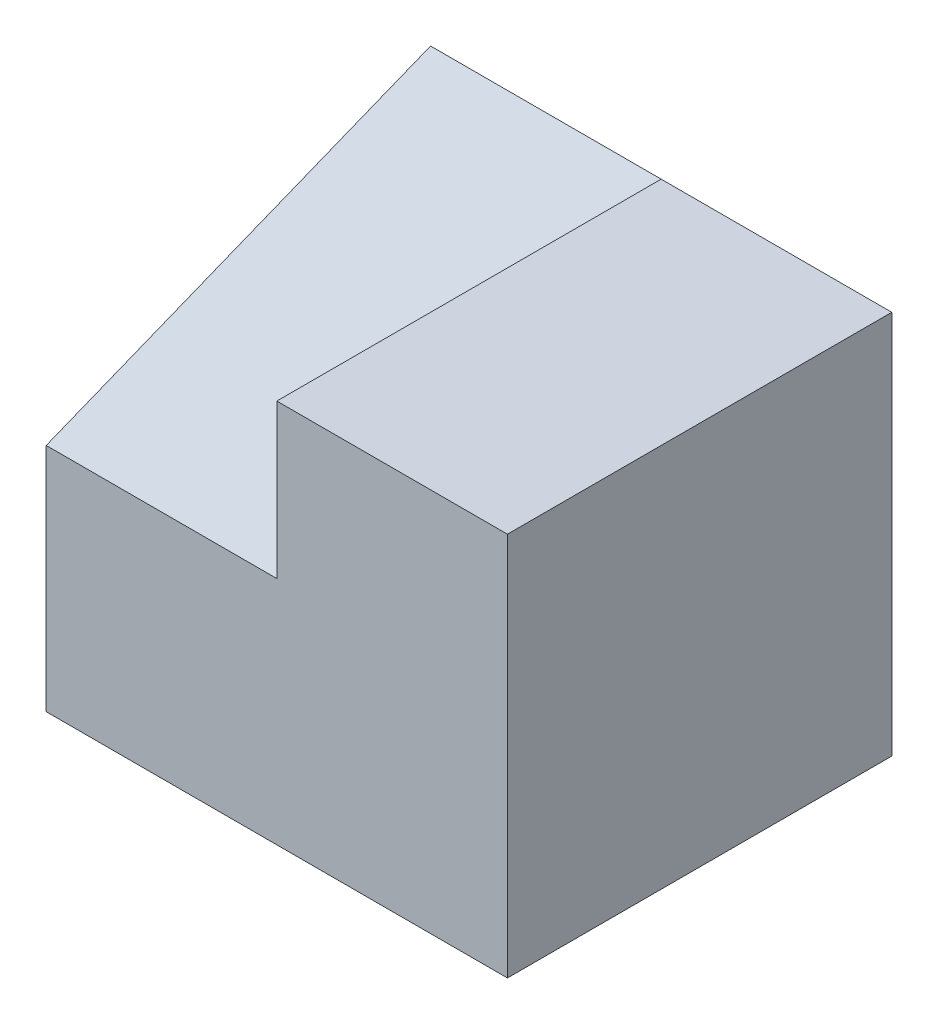
ISO-10303-21;
HEADER;
FILE_DESCRIPTION(('STEP AP214'),'2;1');
FILE_NAME('part.step','',(''),(''),'','','');
FILE_SCHEMA(('AUTOMOTIVE_DESIGN { 1 0 10303 214 1 1 1 1 }'));
ENDSEC;
DATA;
#1=APPLICATION_CONTEXT('core data for automotive mechanical design processes');
#2=APPLICATION_PROTOCOL_DEFINITION('international standard','automotive_design',2000,#1);
#3=PRODUCT_CONTEXT('',#1,'mechanical');
#4=PRODUCT('Part','Part','',(#3));
#5=PRODUCT_RELATED_PRODUCT_CATEGORY('part','',(#4));
#6=PRODUCT_DEFINITION_FORMATION('','',#4);
#7=PRODUCT_DEFINITION_CONTEXT('part definition',#1,'design');
#8=PRODUCT_DEFINITION('design','',#6,#7);
#9=PRODUCT_DEFINITION_SHAPE('','',#8);
#10=(LENGTH_UNIT() NAMED_UNIT(*) SI_UNIT(.MILLI.,.METRE.));
#11=(NAMED_UNIT(*) PLANE_ANGLE_UNIT() SI_UNIT($,.RADIAN.));
#12=(NAMED_UNIT(*) SI_UNIT($,.STERADIAN.) SOLID_ANGLE_UNIT());
#13=UNCERTAINTY_MEASURE_WITH_UNIT(LENGTH_MEASURE(1.E-05),#10,'distance_accuracy_value','');
#14=(GEOMETRIC_REPRESENTATION_CONTEXT(3) GLOBAL_UNCERTAINTY_ASSIGNED_CONTEXT((#13)) GLOBAL_UNIT_ASSIGNED_CONTEXT((#10,
#11,#12)) REPRESENTATION_CONTEXT('',''));
#15=CARTESIAN_POINT('',(0.,0.,0.));
#16=DIRECTION('',(0.,0.,1.));
#17=DIRECTION('',(1.,0.,0.));
#18=AXIS2_PLACEMENT_3D('',#15,#16,#17);
#19=CARTESIAN_POINT('',(-15.,15.,25.));
#20=DIRECTION('',(1.,0.,0.));
#21=DIRECTION('',(0.,0.,-1.));
#22=AXIS2_PLACEMENT_3D('',#19,#20,#21);
#23=PLANE('',#22);
#24=DIRECTION('',(0.,0.371390676354104,-0.928476690885259));
#25=VECTOR('',#24,1.);
#26=CARTESIAN_POINT('',(-15.,25.,0.));
#27=LINE('',#26,#25);
#28=CARTESIAN_POINT('',(-15.,15.,25.));
#29=VERTEX_POINT('',#28);
#30=CARTESIAN_POINT('',(-15.,25.,0.));
#31=VERTEX_POINT('',#30);
#32=EDGE_CURVE('E108',#29,#31,#27,.T.);
#33=ORIENTED_EDGE('',*,*,#32,.F.);
#34=DIRECTION('',(0.,-1.,0.));
#35=VECTOR('',#34,1.);
#36=CARTESIAN_POINT('',(-15.,15.,25.));
#37=LINE('',#36,#35);
#38=CARTESIAN_POINT('',(-15.,25.,25.));
#39=VERTEX_POINT('',#38);
#40=EDGE_CURVE('E97',#39,#29,#37,.T.);
#41=ORIENTED_EDGE('',*,*,#40,.F.);
#42=DIRECTION('',(0.,0.,-1.));
#43=VECTOR('',#42,1.);
#44=CARTESIAN_POINT('',(-15.,25.,25.));
#45=LINE('',#44,#43);
#46=EDGE_CURVE('E102',#39,#31,#45,.T.);
#47=ORIENTED_EDGE('',*,*,#46,.T.);
#48=EDGE_LOOP('',(#33,#41,#47));
#49=FACE_BOUND('',#48,.T.);
#50=ADVANCED_FACE('F33',(#49),#23,.F.);
#51=CARTESIAN_POINT('',(-30.,0.,25.));
#52=DIRECTION('',(1.,0.,0.));
#53=DIRECTION('',(0.,0.,-1.));
#54=AXIS2_PLACEMENT_3D('',#51,#52,#53);
#55=PLANE('',#54);
#56=DIRECTION('',(0.,-1.,0.));
#57=VECTOR('',#56,1.);
#58=CARTESIAN_POINT('',(-30.,0.,0.));
#59=LINE('',#58,#57);
#60=CARTESIAN_POINT('',(-30.,25.,0.));
#61=VERTEX_POINT('',#60);
#62=CARTESIAN_POINT('',(-30.,10.,0.));
#63=VERTEX_POINT('',#62);
#64=EDGE_CURVE('E113',#61,#63,#59,.T.);
#65=ORIENTED_EDGE('',*,*,#64,.T.);
#66=DIRECTION('',(0.,0.,-1.));
#67=VECTOR('',#66,1.);
#68=CARTESIAN_POINT('',(-30.,10.,14.));
#69=LINE('',#68,#67);
#70=CARTESIAN_POINT('',(-30.,10.,14.));
#71=VERTEX_POINT('',#70);
#72=EDGE_CURVE('E48',#71,#63,#69,.T.);
#73=ORIENTED_EDGE('',*,*,#72,.F.);
#74=DIRECTION('',(0.,1.,0.));
#75=VECTOR('',#74,1.);
#76=CARTESIAN_POINT('',(-30.,10.,14.));
#77=LINE('',#76,#75);
#78=CARTESIAN_POINT('',(-30.,0.,14.));
#79=VERTEX_POINT('',#78);
#80=EDGE_CURVE('E149',#79,#71,#77,.T.);
#81=ORIENTED_EDGE('',*,*,#80,.F.);
#82=DIRECTION('',(0.,0.,-1.));
#83=VECTOR('',#82,1.);
#84=CARTESIAN_POINT('',(-30.,0.,25.));
#85=LINE('',#84,#83);
#86=CARTESIAN_POINT('',(-30.,0.,25.));
#87=VERTEX_POINT('',#86);
#88=EDGE_CURVE('E11',#87,#79,#85,.T.);
#89=ORIENTED_EDGE('',*,*,#88,.F.);
#90=DIRECTION('',(0.,-1.,0.));
#91=VECTOR('',#90,1.);
#92=CARTESIAN_POINT('',(-30.,0.,25.));
#93=LINE('',#92,#91);
#94=CARTESIAN_POINT('',(-30.,15.,25.));
#95=VERTEX_POINT('',#94);
#96=EDGE_CURVE('E121',#95,#87,#93,.T.);
#97=ORIENTED_EDGE('',*,*,#96,.F.);
#98=DIRECTION('',(0.,0.371390676354104,-0.928476690885259));
#99=VECTOR('',#98,1.);
#100=CARTESIAN_POINT('',(-30.,25.,0.));
#101=LINE('',#100,#99);
#102=EDGE_CURVE('E138',#95,#61,#101,.T.);
#103=ORIENTED_EDGE('',*,*,#102,.T.);
#104=EDGE_LOOP('',(#65,#73,#81,#89,#97,#103));
#105=FACE_BOUND('',#104,.T.);
#106=ADVANCED_FACE('F35',(#105),#55,.F.);
#107=CARTESIAN_POINT('',(0.,0.,25.));
#108=DIRECTION('',(0.,1.,0.));
#109=DIRECTION('',(0.,0.,1.));
#110=AXIS2_PLACEMENT_3D('',#107,#108,#109);
#111=PLANE('',#110);
#112=DIRECTION('',(-1.,0.,0.));
#113=VECTOR('',#112,1.);
#114=CARTESIAN_POINT('',(-30.,0.,14.));
#115=LINE('',#114,#113);
#116=CARTESIAN_POINT('',(-15.,0.,14.));
#117=VERTEX_POINT('',#116);
#118=EDGE_CURVE('E155',#117,#79,#115,.T.);
#119=ORIENTED_EDGE('',*,*,#118,.F.);
#120=DIRECTION('',(0.,0.,-1.));
#121=VECTOR('',#120,1.);
#122=CARTESIAN_POINT('',(-15.,0.,14.));
#123=LINE('',#122,#121);
#124=CARTESIAN_POINT('',(-15.,0.,0.));
#125=VERTEX_POINT('',#124);
#126=EDGE_CURVE('E177',#117,#125,#123,.T.);
#127=ORIENTED_EDGE('',*,*,#126,.T.);
#128=DIRECTION('',(1.,0.,0.));
#129=VECTOR('',#128,1.);
#130=CARTESIAN_POINT('',(0.,0.,0.));
#131=LINE('',#130,#129);
#132=CARTESIAN_POINT('',(0.,0.,0.));
#133=VERTEX_POINT('',#132);
#134=EDGE_CURVE('E116',#125,#133,#131,.T.);
#135=ORIENTED_EDGE('',*,*,#134,.T.);
#136=DIRECTION('',(0.,0.,-1.));
#137=VECTOR('',#136,1.);
#138=CARTESIAN_POINT('',(0.,0.,25.));
#139=LINE('',#138,#137);
#140=CARTESIAN_POINT('',(0.,0.,25.));
#141=VERTEX_POINT('',#140);
#142=EDGE_CURVE('E41',#141,#133,#139,.T.);
#143=ORIENTED_EDGE('',*,*,#142,.F.);
#144=DIRECTION('',(1.,0.,0.));
#145=VECTOR('',#144,1.);
#146=CARTESIAN_POINT('',(0.,0.,25.));
#147=LINE('',#146,#145);
#148=EDGE_CURVE('E85',#87,#141,#147,.T.);
#149=ORIENTED_EDGE('',*,*,#148,.F.);
#150=ORIENTED_EDGE('',*,*,#88,.T.);
#151=EDGE_LOOP('',(#119,#127,#135,#143,#149,#150));
#152=FACE_BOUND('',#151,.T.);
#153=ADVANCED_FACE('F151',(#152),#111,.F.);
#154=CARTESIAN_POINT('',(0.,25.,25.));
#155=DIRECTION('',(-1.,0.,0.));
#156=DIRECTION('',(0.,-1.,0.));
#157=AXIS2_PLACEMENT_3D('',#154,#155,#156);
#158=PLANE('',#157);
#159=DIRECTION('',(0.,1.,0.));
#160=VECTOR('',#159,1.);
#161=CARTESIAN_POINT('',(0.,25.,0.));
#162=LINE('',#161,#160);
#163=CARTESIAN_POINT('',(0.,25.,0.));
#164=VERTEX_POINT('',#163);
#165=EDGE_CURVE('E119',#133,#164,#162,.T.);
#166=ORIENTED_EDGE('',*,*,#165,.T.);
#167=DIRECTION('',(0.,0.,-1.));
#168=VECTOR('',#167,1.);
#169=CARTESIAN_POINT('',(0.,25.,25.));
#170=LINE('',#169,#168);
#171=CARTESIAN_POINT('',(0.,25.,25.));
#172=VERTEX_POINT('',#171);
#173=EDGE_CURVE('E106',#172,#164,#170,.T.);
#174=ORIENTED_EDGE('',*,*,#173,.F.);
#175=DIRECTION('',(0.,1.,0.));
#176=VECTOR('',#175,1.);
#177=CARTESIAN_POINT('',(0.,25.,25.));
#178=LINE('',#177,#176);
#179=EDGE_CURVE('E99',#141,#172,#178,.T.);
#180=ORIENTED_EDGE('',*,*,#179,.F.);
#181=ORIENTED_EDGE('',*,*,#142,.T.);
#182=EDGE_LOOP('',(#166,#174,#180,#181));
#183=FACE_BOUND('',#182,.T.);
#184=ADVANCED_FACE('F126',(#183),#158,.F.);
#185=CARTESIAN_POINT('',(-15.,25.,25.));
#186=DIRECTION('',(0.,-1.,0.));
#187=DIRECTION('',(1.,0.,0.));
#188=AXIS2_PLACEMENT_3D('',#185,#186,#187);
#189=PLANE('',#188);
#190=DIRECTION('',(-1.,0.,0.));
#191=VECTOR('',#190,1.);
#192=CARTESIAN_POINT('',(-15.,25.,0.));
#193=LINE('',#192,#191);
#194=EDGE_CURVE('E77',#164,#31,#193,.T.);
#195=ORIENTED_EDGE('',*,*,#194,.T.);
#196=ORIENTED_EDGE('',*,*,#46,.F.);
#197=DIRECTION('',(-1.,0.,0.));
#198=VECTOR('',#197,1.);
#199=CARTESIAN_POINT('',(-15.,25.,25.));
#200=LINE('',#199,#198);
#201=EDGE_CURVE('E94',#172,#39,#200,.T.);
#202=ORIENTED_EDGE('',*,*,#201,.F.);
#203=ORIENTED_EDGE('',*,*,#173,.T.);
#204=EDGE_LOOP('',(#195,#196,#202,#203));
#205=FACE_BOUND('',#204,.T.);
#206=ADVANCED_FACE('F103',(#205),#189,.F.);
#207=CARTESIAN_POINT('',(0.,0.,25.));
#208=DIRECTION('',(0.,0.,-1.));
#209=DIRECTION('',(-1.,0.,0.));
#210=AXIS2_PLACEMENT_3D('',#207,#208,#209);
#211=PLANE('',#210);
#212=ORIENTED_EDGE('',*,*,#96,.T.);
#213=ORIENTED_EDGE('',*,*,#148,.T.);
#214=ORIENTED_EDGE('',*,*,#179,.T.);
#215=ORIENTED_EDGE('',*,*,#201,.T.);
#216=ORIENTED_EDGE('',*,*,#40,.T.);
#217=DIRECTION('',(-1.,0.,0.));
#218=VECTOR('',#217,1.);
#219=CARTESIAN_POINT('',(-30.,15.,25.));
#220=LINE('',#219,#218);
#221=EDGE_CURVE('E57',#29,#95,#220,.T.);
#222=ORIENTED_EDGE('',*,*,#221,.T.);
#223=EDGE_LOOP('',(#212,#213,#214,#215,#216,#222));
#224=FACE_BOUND('',#223,.T.);
#225=ADVANCED_FACE('F95',(#224),#211,.F.);
#226=CARTESIAN_POINT('',(0.,0.,0.));
#227=DIRECTION('',(0.,0.,-1.));
#228=DIRECTION('',(-1.,0.,0.));
#229=AXIS2_PLACEMENT_3D('',#226,#227,#228);
#230=PLANE('',#229);
#231=DIRECTION('',(0.,-1.,0.));
#232=VECTOR('',#231,1.);
#233=CARTESIAN_POINT('',(-15.,0.,0.));
#234=LINE('',#233,#232);
#235=CARTESIAN_POINT('',(-15.,10.,0.));
#236=VERTEX_POINT('',#235);
#237=EDGE_CURVE('E174',#236,#125,#234,.T.);
#238=ORIENTED_EDGE('',*,*,#237,.F.);
#239=DIRECTION('',(1.,0.,0.));
#240=VECTOR('',#239,1.);
#241=CARTESIAN_POINT('',(-15.,10.,0.));
#242=LINE('',#241,#240);
#243=EDGE_CURVE('E179',#63,#236,#242,.T.);
#244=ORIENTED_EDGE('',*,*,#243,.F.);
#245=ORIENTED_EDGE('',*,*,#64,.F.);
#246=DIRECTION('',(1.,0.,0.));
#247=VECTOR('',#246,1.);
#248=CARTESIAN_POINT('',(-30.,25.,0.));
#249=LINE('',#248,#247);
#250=EDGE_CURVE('E117',#61,#31,#249,.T.);
#251=ORIENTED_EDGE('',*,*,#250,.T.);
#252=ORIENTED_EDGE('',*,*,#194,.F.);
#253=ORIENTED_EDGE('',*,*,#165,.F.);
#254=ORIENTED_EDGE('',*,*,#134,.F.);
#255=EDGE_LOOP('',(#238,#244,#245,#251,#252,#253,#254));
#256=FACE_BOUND('',#255,.T.);
#257=ADVANCED_FACE('F130',(#256),#230,.T.);
#258=CARTESIAN_POINT('',(-30.,25.,0.));
#259=DIRECTION('',(0.,-0.928476690885259,-0.371390676354104));
#260=DIRECTION('',(0.,0.371390676354104,-0.928476690885259));
#261=AXIS2_PLACEMENT_3D('',#258,#259,#260);
#262=PLANE('',#261);
#263=ORIENTED_EDGE('',*,*,#32,.T.);
#264=ORIENTED_EDGE('',*,*,#250,.F.);
#265=ORIENTED_EDGE('',*,*,#102,.F.);
#266=ORIENTED_EDGE('',*,*,#221,.F.);
#267=EDGE_LOOP('',(#263,#264,#265,#266));
#268=FACE_BOUND('',#267,.T.);
#269=ADVANCED_FACE('F191',(#268),#262,.F.);
#270=CARTESIAN_POINT('',(-15.,0.,14.));
#271=DIRECTION('',(1.,0.,0.));
#272=DIRECTION('',(0.,0.,-1.));
#273=AXIS2_PLACEMENT_3D('',#270,#271,#272);
#274=PLANE('',#273);
#275=ORIENTED_EDGE('',*,*,#237,.T.);
#276=ORIENTED_EDGE('',*,*,#126,.F.);
#277=DIRECTION('',(0.,-1.,0.));
#278=VECTOR('',#277,1.);
#279=CARTESIAN_POINT('',(-15.,0.,14.));
#280=LINE('',#279,#278);
#281=CARTESIAN_POINT('',(-15.,10.,14.));
#282=VERTEX_POINT('',#281);
#283=EDGE_CURVE('E175',#282,#117,#280,.T.);
#284=ORIENTED_EDGE('',*,*,#283,.F.);
#285=DIRECTION('',(0.,0.,-1.));
#286=VECTOR('',#285,1.);
#287=CARTESIAN_POINT('',(-15.,10.,14.));
#288=LINE('',#287,#286);
#289=EDGE_CURVE('E172',#282,#236,#288,.T.);
#290=ORIENTED_EDGE('',*,*,#289,.T.);
#291=EDGE_LOOP('',(#275,#276,#284,#290));
#292=FACE_BOUND('',#291,.T.);
#293=ADVANCED_FACE('F173',(#292),#274,.F.);
#294=CARTESIAN_POINT('',(-15.,10.,14.));
#295=DIRECTION('',(0.,1.,0.));
#296=DIRECTION('',(-1.,0.,0.));
#297=AXIS2_PLACEMENT_3D('',#294,#295,#296);
#298=PLANE('',#297);
#299=ORIENTED_EDGE('',*,*,#243,.T.);
#300=ORIENTED_EDGE('',*,*,#289,.F.);
#301=DIRECTION('',(1.,0.,0.));
#302=VECTOR('',#301,1.);
#303=CARTESIAN_POINT('',(-15.,10.,14.));
#304=LINE('',#303,#302);
#305=EDGE_CURVE('E187',#71,#282,#304,.T.);
#306=ORIENTED_EDGE('',*,*,#305,.F.);
#307=ORIENTED_EDGE('',*,*,#72,.T.);
#308=EDGE_LOOP('',(#299,#300,#306,#307));
#309=FACE_BOUND('',#308,.T.);
#310=ADVANCED_FACE('F180',(#309),#298,.F.);
#311=CARTESIAN_POINT('',(0.,0.,14.));
#312=DIRECTION('',(0.,0.,1.));
#313=DIRECTION('',(1.,0.,0.));
#314=AXIS2_PLACEMENT_3D('',#311,#312,#313);
#315=PLANE('',#314);
#316=ORIENTED_EDGE('',*,*,#118,.T.);
#317=ORIENTED_EDGE('',*,*,#80,.T.);
#318=ORIENTED_EDGE('',*,*,#305,.T.);
#319=ORIENTED_EDGE('',*,*,#283,.T.);
#320=EDGE_LOOP('',(#316,#317,#318,#319));
#321=FACE_BOUND('',#320,.T.);
#322=ADVANCED_FACE('F190',(#321),#315,.F.);
#323=CLOSED_SHELL('',(#50,#106,#153,#184,#206,#225,#257,#269,#293,#310,#322));
#324=MANIFOLD_SOLID_BREP('B2',#323);
#325=ADVANCED_BREP_SHAPE_REPRESENTATION('',(#18,#324),#14);
#326=SHAPE_DEFINITION_REPRESENTATION(#9,#325);
ENDSEC;
END-ISO-10303-21;
